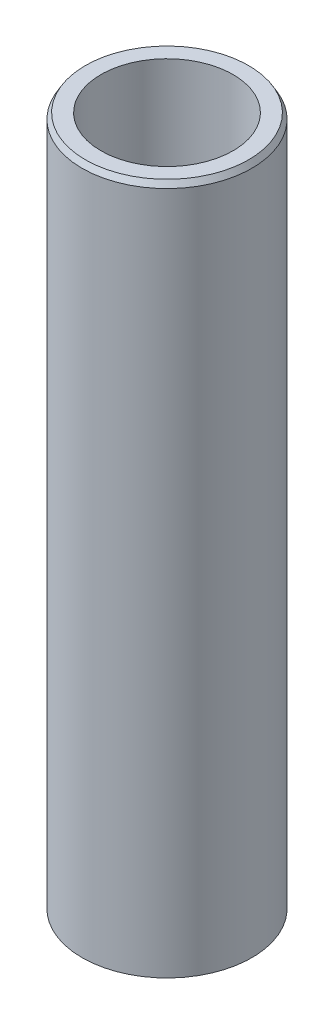
ISO-10303-21;
HEADER;
FILE_DESCRIPTION(('STEP AP214'),'2;1');
FILE_NAME('part.step','',(''),(''),'','','');
FILE_SCHEMA(('AUTOMOTIVE_DESIGN { 1 0 10303 214 1 1 1 1 }'));
ENDSEC;
DATA;
#1=APPLICATION_CONTEXT('core data for automotive mechanical design processes');
#2=APPLICATION_PROTOCOL_DEFINITION('international standard','automotive_design',2000,#1);
#3=PRODUCT_CONTEXT('',#1,'mechanical');
#4=PRODUCT('Part','Part','',(#3));
#5=PRODUCT_RELATED_PRODUCT_CATEGORY('part','',(#4));
#6=PRODUCT_DEFINITION_FORMATION('','',#4);
#7=PRODUCT_DEFINITION_CONTEXT('part definition',#1,'design');
#8=PRODUCT_DEFINITION('design','',#6,#7);
#9=PRODUCT_DEFINITION_SHAPE('','',#8);
#10=(LENGTH_UNIT() NAMED_UNIT(*) SI_UNIT(.MILLI.,.METRE.));
#11=(NAMED_UNIT(*) PLANE_ANGLE_UNIT() SI_UNIT($,.RADIAN.));
#12=(NAMED_UNIT(*) SI_UNIT($,.STERADIAN.) SOLID_ANGLE_UNIT());
#13=UNCERTAINTY_MEASURE_WITH_UNIT(LENGTH_MEASURE(1.E-05),#10,'distance_accuracy_value','');
#14=(GEOMETRIC_REPRESENTATION_CONTEXT(3) GLOBAL_UNCERTAINTY_ASSIGNED_CONTEXT((#13)) GLOBAL_UNIT_ASSIGNED_CONTEXT((#10,
#11,#12)) REPRESENTATION_CONTEXT('',''));
#15=CARTESIAN_POINT('',(0.,0.,0.));
#16=DIRECTION('',(0.,0.,1.));
#17=DIRECTION('',(1.,0.,0.));
#18=AXIS2_PLACEMENT_3D('',#15,#16,#17);
#19=CARTESIAN_POINT('',(0.,428.11443300045,0.));
#20=DIRECTION('',(0.,-1.,0.));
#21=DIRECTION('',(0.,0.,-1.));
#22=AXIS2_PLACEMENT_3D('',#19,#20,#21);
#23=CYLINDRICAL_SURFACE('',#22,52.5);
#24=CARTESIAN_POINT('',(0.,424.578605404179,0.));
#25=DIRECTION('',(0.,1.,0.));
#26=DIRECTION('',(0.,0.,1.));
#27=AXIS2_PLACEMENT_3D('',#24,#25,#26);
#28=CIRCLE('',#27,52.5);
#29=CARTESIAN_POINT('',(0.,424.578605404179,52.5));
#30=VERTEX_POINT('',#29);
#31=EDGE_CURVE('E50',#30,#30,#28,.F.);
#32=ORIENTED_EDGE('',*,*,#31,.T.);
#33=EDGE_LOOP('',(#32));
#34=FACE_BOUND('',#33,.T.);
#35=CARTESIAN_POINT('',(0.,2.04141101451499,0.));
#36=DIRECTION('',(0.,1.,0.));
#37=DIRECTION('',(0.,0.,1.));
#38=AXIS2_PLACEMENT_3D('',#35,#36,#37);
#39=CIRCLE('',#38,52.5);
#40=CARTESIAN_POINT('',(0.,2.04141101451499,52.5));
#41=VERTEX_POINT('',#40);
#42=EDGE_CURVE('E51',#41,#41,#39,.T.);
#43=ORIENTED_EDGE('',*,*,#42,.T.);
#44=EDGE_LOOP('',(#43));
#45=FACE_BOUND('',#44,.T.);
#46=ADVANCED_FACE('F39',(#34,#45),#23,.T.);
#47=CARTESIAN_POINT('',(0.,428.11443300045,0.));
#48=DIRECTION('',(0.,1.,0.));
#49=DIRECTION('',(0.,0.,1.));
#50=AXIS2_PLACEMENT_3D('',#47,#48,#49);
#51=PLANE('',#50);
#52=CARTESIAN_POINT('',(0.,428.11443300045,0.));
#53=DIRECTION('',(0.,1.,0.));
#54=DIRECTION('',(0.,0.,1.));
#55=AXIS2_PLACEMENT_3D('',#52,#53,#54);
#56=CIRCLE('',#55,50.4585889854851);
#57=CARTESIAN_POINT('',(0.,428.11443300045,50.4585889854851));
#58=VERTEX_POINT('',#57);
#59=EDGE_CURVE('E54',#58,#58,#56,.T.);
#60=ORIENTED_EDGE('',*,*,#59,.T.);
#61=EDGE_LOOP('',(#60));
#62=FACE_BOUND('',#61,.T.);
#63=CARTESIAN_POINT('',(0.,428.11443300045,0.));
#64=DIRECTION('',(0.,1.,0.));
#65=DIRECTION('',(0.,0.,1.));
#66=AXIS2_PLACEMENT_3D('',#63,#64,#65);
#67=CIRCLE('',#66,40.8382784865022);
#68=CARTESIAN_POINT('',(0.,428.11443300045,40.8382784865022));
#69=VERTEX_POINT('',#68);
#70=EDGE_CURVE('E58',#69,#69,#67,.T.);
#71=ORIENTED_EDGE('',*,*,#70,.F.);
#72=EDGE_LOOP('',(#71));
#73=FACE_BOUND('',#72,.T.);
#74=ADVANCED_FACE('F69',(#62,#73),#51,.T.);
#75=CARTESIAN_POINT('',(0.,0.,0.));
#76=DIRECTION('',(0.,1.,0.));
#77=DIRECTION('',(0.,0.,1.));
#78=AXIS2_PLACEMENT_3D('',#75,#76,#77);
#79=PLANE('',#78);
#80=CARTESIAN_POINT('',(0.,0.,0.));
#81=DIRECTION('',(0.,1.,0.));
#82=DIRECTION('',(0.,0.,1.));
#83=AXIS2_PLACEMENT_3D('',#80,#81,#82);
#84=CIRCLE('',#83,48.9641724037293);
#85=CARTESIAN_POINT('',(0.,0.,48.9641724037293));
#86=VERTEX_POINT('',#85);
#87=EDGE_CURVE('E10',#86,#86,#84,.F.);
#88=ORIENTED_EDGE('',*,*,#87,.T.);
#89=EDGE_LOOP('',(#88));
#90=FACE_BOUND('',#89,.T.);
#91=CARTESIAN_POINT('',(0.,0.,0.));
#92=DIRECTION('',(0.,1.,0.));
#93=DIRECTION('',(0.,0.,1.));
#94=AXIS2_PLACEMENT_3D('',#91,#92,#93);
#95=CIRCLE('',#94,40.8382784865022);
#96=CARTESIAN_POINT('',(0.,0.,40.8382784865022));
#97=VERTEX_POINT('',#96);
#98=EDGE_CURVE('E63',#97,#97,#95,.T.);
#99=ORIENTED_EDGE('',*,*,#98,.T.);
#100=EDGE_LOOP('',(#99));
#101=FACE_BOUND('',#100,.T.);
#102=ADVANCED_FACE('F75',(#90,#101),#79,.F.);
#103=CARTESIAN_POINT('',(0.,428.11443300045,0.));
#104=DIRECTION('',(0.,-1.,0.));
#105=DIRECTION('',(0.,0.,-1.));
#106=AXIS2_PLACEMENT_3D('',#103,#104,#105);
#107=CYLINDRICAL_SURFACE('',#106,40.8382784865022);
#108=ORIENTED_EDGE('',*,*,#70,.T.);
#109=EDGE_LOOP('',(#108));
#110=FACE_BOUND('',#109,.T.);
#111=ORIENTED_EDGE('',*,*,#98,.F.);
#112=EDGE_LOOP('',(#111));
#113=FACE_BOUND('',#112,.T.);
#114=ADVANCED_FACE('F70',(#110,#113),#107,.F.);
#115=CARTESIAN_POINT('',(0.,428.11443300045,0.));
#116=DIRECTION('',(0.,-1.,0.));
#117=DIRECTION('',(0.,0.,-1.));
#118=AXIS2_PLACEMENT_3D('',#115,#116,#117);
#119=CONICAL_SURFACE('',#118,50.4585889854851,0.523598775598296);
#120=ORIENTED_EDGE('',*,*,#31,.F.);
#121=EDGE_LOOP('',(#120));
#122=FACE_BOUND('',#121,.T.);
#123=ORIENTED_EDGE('',*,*,#59,.F.);
#124=EDGE_LOOP('',(#123));
#125=FACE_BOUND('',#124,.T.);
#126=ADVANCED_FACE('F81',(#122,#125),#119,.T.);
#127=CARTESIAN_POINT('',(0.,2.04141101451499,0.));
#128=DIRECTION('',(0.,1.,0.));
#129=DIRECTION('',(0.,0.,1.));
#130=AXIS2_PLACEMENT_3D('',#127,#128,#129);
#131=CONICAL_SURFACE('',#130,52.5,1.0471975511966);
#132=ORIENTED_EDGE('',*,*,#87,.F.);
#133=EDGE_LOOP('',(#132));
#134=FACE_BOUND('',#133,.T.);
#135=ORIENTED_EDGE('',*,*,#42,.F.);
#136=EDGE_LOOP('',(#135));
#137=FACE_BOUND('',#136,.T.);
#138=ADVANCED_FACE('F45',(#134,#137),#131,.T.);
#139=CLOSED_SHELL('',(#46,#74,#102,#114,#126,#138));
#140=MANIFOLD_SOLID_BREP('B2',#139);
#141=ADVANCED_BREP_SHAPE_REPRESENTATION('',(#18,#140),#14);
#142=SHAPE_DEFINITION_REPRESENTATION(#9,#141);
ENDSEC;
END-ISO-10303-21;
